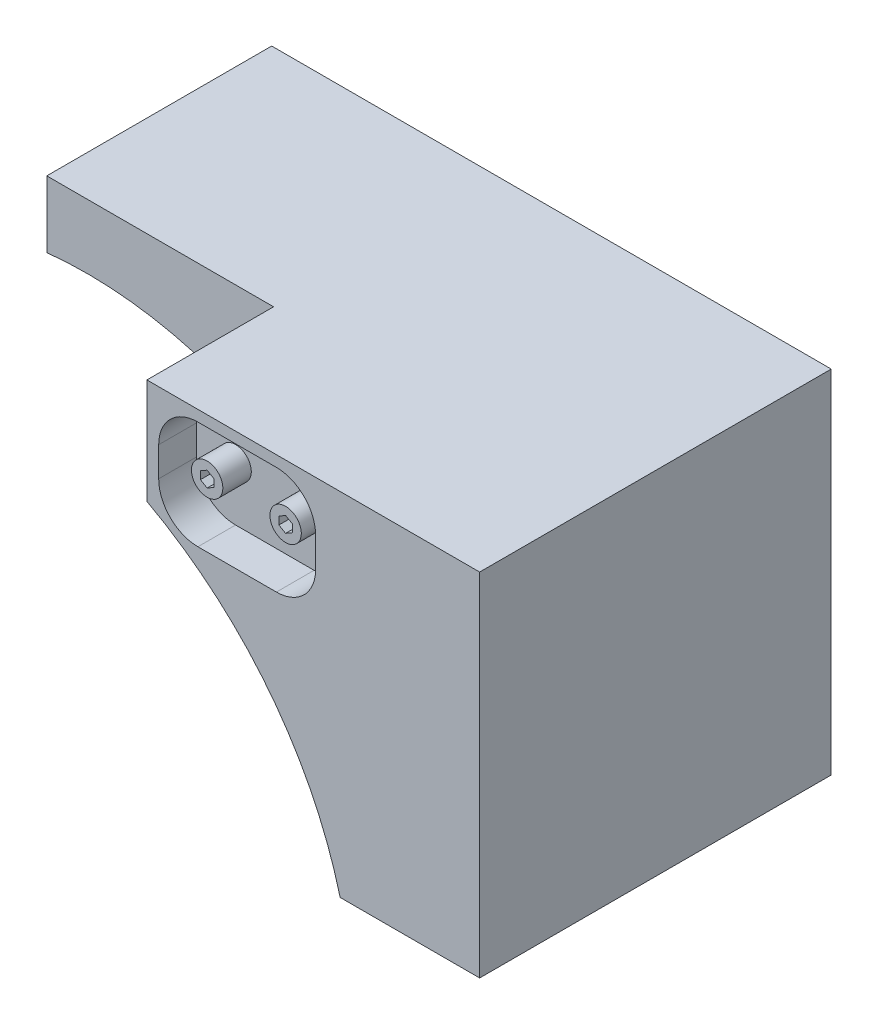
ISO-10303-21;
HEADER;
FILE_DESCRIPTION(('STEP AP214'),'2;1');
FILE_NAME('part.step','',(''),(''),'','','');
FILE_SCHEMA(('AUTOMOTIVE_DESIGN { 1 0 10303 214 1 1 1 1 }'));
ENDSEC;
DATA;
#1=APPLICATION_CONTEXT('core data for automotive mechanical design processes');
#2=APPLICATION_PROTOCOL_DEFINITION('international standard','automotive_design',2000,#1);
#3=PRODUCT_CONTEXT('',#1,'mechanical');
#4=PRODUCT('Part','Part','',(#3));
#5=PRODUCT_RELATED_PRODUCT_CATEGORY('part','',(#4));
#6=PRODUCT_DEFINITION_FORMATION('','',#4);
#7=PRODUCT_DEFINITION_CONTEXT('part definition',#1,'design');
#8=PRODUCT_DEFINITION('design','',#6,#7);
#9=PRODUCT_DEFINITION_SHAPE('','',#8);
#10=(LENGTH_UNIT() NAMED_UNIT(*) SI_UNIT(.MILLI.,.METRE.));
#11=(NAMED_UNIT(*) PLANE_ANGLE_UNIT() SI_UNIT($,.RADIAN.));
#12=(NAMED_UNIT(*) SI_UNIT($,.STERADIAN.) SOLID_ANGLE_UNIT());
#13=UNCERTAINTY_MEASURE_WITH_UNIT(LENGTH_MEASURE(1.E-05),#10,'distance_accuracy_value','');
#14=(GEOMETRIC_REPRESENTATION_CONTEXT(3) GLOBAL_UNCERTAINTY_ASSIGNED_CONTEXT((#13)) GLOBAL_UNIT_ASSIGNED_CONTEXT((#10,
#11,#12)) REPRESENTATION_CONTEXT('',''));
#15=CARTESIAN_POINT('',(0.,0.,0.));
#16=DIRECTION('',(0.,0.,1.));
#17=DIRECTION('',(1.,0.,0.));
#18=AXIS2_PLACEMENT_3D('',#15,#16,#17);
#19=CARTESIAN_POINT('',(658.837491164178,534.14860150002,56.8037083256615));
#20=DIRECTION('',(0.500000000000038,0.866025403784417,0.));
#21=DIRECTION('',(-0.866025403784417,0.500000000000038,0.));
#22=AXIS2_PLACEMENT_3D('',#19,#20,#21);
#23=PLANE('',#22);
#24=DIRECTION('',(0.,0.,-1.));
#25=VECTOR('',#24,1.);
#26=CARTESIAN_POINT('',(658.837491164178,534.14860150002,56.8037083256615));
#27=LINE('',#26,#25);
#28=CARTESIAN_POINT('',(658.837491164178,534.14860150002,53.6287083256614));
#29=VERTEX_POINT('',#28);
#30=CARTESIAN_POINT('',(658.837491164178,534.14860150002,56.8037083256615));
#31=VERTEX_POINT('',#30);
#32=EDGE_CURVE('E328',#29,#31,#27,.F.);
#33=ORIENTED_EDGE('',*,*,#32,.T.);
#34=DIRECTION('',(-0.866025403784417,0.500000000000038,0.));
#35=VECTOR('',#34,1.);
#36=CARTESIAN_POINT('',(658.837491164178,534.14860150002,56.8037083256615));
#37=LINE('',#36,#35);
#38=CARTESIAN_POINT('',(657.752178948284,534.775206800021,56.8037083256615));
#39=VERTEX_POINT('',#38);
#40=EDGE_CURVE('E337',#39,#31,#37,.F.);
#41=ORIENTED_EDGE('',*,*,#40,.F.);
#42=DIRECTION('',(0.,0.,1.));
#43=VECTOR('',#42,1.);
#44=CARTESIAN_POINT('',(657.752178948284,534.77520680002,56.8037083256615));
#45=LINE('',#44,#43);
#46=CARTESIAN_POINT('',(657.752178948284,534.775206800021,53.6287083256614));
#47=VERTEX_POINT('',#46);
#48=EDGE_CURVE('E318',#39,#47,#45,.F.);
#49=ORIENTED_EDGE('',*,*,#48,.T.);
#50=DIRECTION('',(-0.866025403784417,0.500000000000038,0.));
#51=VECTOR('',#50,1.);
#52=CARTESIAN_POINT('',(658.837491164178,534.14860150002,53.6287083256614));
#53=LINE('',#52,#51);
#54=EDGE_CURVE('E335',#29,#47,#53,.T.);
#55=ORIENTED_EDGE('',*,*,#54,.F.);
#56=EDGE_LOOP('',(#33,#41,#49,#55));
#57=FACE_BOUND('',#56,.T.);
#58=ADVANCED_FACE('F16',(#57),#23,.F.);
#59=CARTESIAN_POINT('',(646.137491164178,534.14860150002,56.8037083256615));
#60=DIRECTION('',(0.500000000000038,0.866025403784417,0.));
#61=DIRECTION('',(-0.866025403784417,0.500000000000038,0.));
#62=AXIS2_PLACEMENT_3D('',#59,#60,#61);
#63=PLANE('',#62);
#64=DIRECTION('',(0.,0.,-1.));
#65=VECTOR('',#64,1.);
#66=CARTESIAN_POINT('',(646.137491164178,534.14860150002,56.8037083256615));
#67=LINE('',#66,#65);
#68=CARTESIAN_POINT('',(646.137491164178,534.14860150002,53.6287083256614));
#69=VERTEX_POINT('',#68);
#70=CARTESIAN_POINT('',(646.137491164178,534.14860150002,56.8037083256615));
#71=VERTEX_POINT('',#70);
#72=EDGE_CURVE('E313',#69,#71,#67,.F.);
#73=ORIENTED_EDGE('',*,*,#72,.T.);
#74=DIRECTION('',(-0.866025403784417,0.500000000000038,0.));
#75=VECTOR('',#74,1.);
#76=CARTESIAN_POINT('',(646.137491164178,534.14860150002,56.8037083256615));
#77=LINE('',#76,#75);
#78=CARTESIAN_POINT('',(645.052178948284,534.775206800021,56.8037083256615));
#79=VERTEX_POINT('',#78);
#80=EDGE_CURVE('E333',#79,#71,#77,.F.);
#81=ORIENTED_EDGE('',*,*,#80,.F.);
#82=DIRECTION('',(0.,0.,1.));
#83=VECTOR('',#82,1.);
#84=CARTESIAN_POINT('',(645.052178948284,534.77520680002,56.8037083256615));
#85=LINE('',#84,#83);
#86=CARTESIAN_POINT('',(645.052178948284,534.775206800021,53.6287083256614));
#87=VERTEX_POINT('',#86);
#88=EDGE_CURVE('E303',#79,#87,#85,.F.);
#89=ORIENTED_EDGE('',*,*,#88,.T.);
#90=DIRECTION('',(-0.866025403784417,0.500000000000038,0.));
#91=VECTOR('',#90,1.);
#92=CARTESIAN_POINT('',(646.137491164178,534.14860150002,53.6287083256614));
#93=LINE('',#92,#91);
#94=EDGE_CURVE('E331',#69,#87,#93,.T.);
#95=ORIENTED_EDGE('',*,*,#94,.F.);
#96=EDGE_LOOP('',(#73,#81,#89,#95));
#97=FACE_BOUND('',#96,.T.);
#98=ADVANCED_FACE('F426',(#97),#63,.F.);
#99=CARTESIAN_POINT('',(658.837491164178,532.89539090002,56.8037083256615));
#100=DIRECTION('',(1.,0.,0.));
#101=DIRECTION('',(0.,0.,-1.));
#102=AXIS2_PLACEMENT_3D('',#99,#100,#101);
#103=PLANE('',#102);
#104=DIRECTION('',(0.,0.,1.));
#105=VECTOR('',#104,1.);
#106=CARTESIAN_POINT('',(658.837491164178,532.895390900021,56.8037083256615));
#107=LINE('',#106,#105);
#108=CARTESIAN_POINT('',(658.837491164178,532.895390900021,53.6287083256614));
#109=VERTEX_POINT('',#108);
#110=CARTESIAN_POINT('',(658.837491164178,532.895390900021,56.8037083256615));
#111=VERTEX_POINT('',#110);
#112=EDGE_CURVE('E298',#109,#111,#107,.T.);
#113=ORIENTED_EDGE('',*,*,#112,.T.);
#114=DIRECTION('',(0.,1.,0.));
#115=VECTOR('',#114,1.);
#116=CARTESIAN_POINT('',(658.837491164178,532.89539090002,56.8037083256615));
#117=LINE('',#116,#115);
#118=EDGE_CURVE('E326',#31,#111,#117,.F.);
#119=ORIENTED_EDGE('',*,*,#118,.F.);
#120=ORIENTED_EDGE('',*,*,#32,.F.);
#121=DIRECTION('',(0.,1.,0.));
#122=VECTOR('',#121,1.);
#123=CARTESIAN_POINT('',(658.837491164178,532.89539090002,53.6287083256614));
#124=LINE('',#123,#122);
#125=EDGE_CURVE('E323',#109,#29,#124,.T.);
#126=ORIENTED_EDGE('',*,*,#125,.F.);
#127=EDGE_LOOP('',(#113,#119,#120,#126));
#128=FACE_BOUND('',#127,.T.);
#129=ADVANCED_FACE('F424',(#128),#103,.F.);
#130=CARTESIAN_POINT('',(657.752178948284,534.77520680002,56.8037083256615));
#131=DIRECTION('',(-0.499999999999984,0.866025403784448,0.));
#132=DIRECTION('',(-0.866025403784448,-0.499999999999984,0.));
#133=AXIS2_PLACEMENT_3D('',#130,#131,#132);
#134=PLANE('',#133);
#135=ORIENTED_EDGE('',*,*,#48,.F.);
#136=DIRECTION('',(-0.866025403784448,-0.499999999999984,0.));
#137=VECTOR('',#136,1.);
#138=CARTESIAN_POINT('',(657.752178948284,534.77520680002,56.8037083256615));
#139=LINE('',#138,#137);
#140=CARTESIAN_POINT('',(656.666866732393,534.148601500021,56.8037083256615));
#141=VERTEX_POINT('',#140);
#142=EDGE_CURVE('E321',#141,#39,#139,.F.);
#143=ORIENTED_EDGE('',*,*,#142,.F.);
#144=DIRECTION('',(0.,0.,1.));
#145=VECTOR('',#144,1.);
#146=CARTESIAN_POINT('',(656.666866732393,534.14860150002,56.8037083256615));
#147=LINE('',#146,#145);
#148=CARTESIAN_POINT('',(656.666866732393,534.148601500021,53.6287083256614));
#149=VERTEX_POINT('',#148);
#150=EDGE_CURVE('E291',#141,#149,#147,.F.);
#151=ORIENTED_EDGE('',*,*,#150,.T.);
#152=DIRECTION('',(-0.866025403784448,-0.499999999999984,0.));
#153=VECTOR('',#152,1.);
#154=CARTESIAN_POINT('',(657.752178948284,534.77520680002,53.6287083256614));
#155=LINE('',#154,#153);
#156=EDGE_CURVE('E316',#47,#149,#155,.T.);
#157=ORIENTED_EDGE('',*,*,#156,.F.);
#158=EDGE_LOOP('',(#135,#143,#151,#157));
#159=FACE_BOUND('',#158,.T.);
#160=ADVANCED_FACE('F419',(#159),#134,.F.);
#161=CARTESIAN_POINT('',(646.137491164178,532.89539090002,56.8037083256615));
#162=DIRECTION('',(1.,0.,0.));
#163=DIRECTION('',(0.,0.,-1.));
#164=AXIS2_PLACEMENT_3D('',#161,#162,#163);
#165=PLANE('',#164);
#166=DIRECTION('',(0.,0.,1.));
#167=VECTOR('',#166,1.);
#168=CARTESIAN_POINT('',(646.137491164178,532.895390900021,56.8037083256615));
#169=LINE('',#168,#167);
#170=CARTESIAN_POINT('',(646.137491164178,532.895390900021,53.6287083256614));
#171=VERTEX_POINT('',#170);
#172=CARTESIAN_POINT('',(646.137491164178,532.895390900021,56.8037083256615));
#173=VERTEX_POINT('',#172);
#174=EDGE_CURVE('E283',#171,#173,#169,.T.);
#175=ORIENTED_EDGE('',*,*,#174,.T.);
#176=DIRECTION('',(0.,1.,0.));
#177=VECTOR('',#176,1.);
#178=CARTESIAN_POINT('',(646.137491164178,532.89539090002,56.8037083256615));
#179=LINE('',#178,#177);
#180=EDGE_CURVE('E311',#71,#173,#179,.F.);
#181=ORIENTED_EDGE('',*,*,#180,.F.);
#182=ORIENTED_EDGE('',*,*,#72,.F.);
#183=DIRECTION('',(0.,1.,0.));
#184=VECTOR('',#183,1.);
#185=CARTESIAN_POINT('',(646.137491164178,532.89539090002,53.6287083256614));
#186=LINE('',#185,#184);
#187=EDGE_CURVE('E308',#171,#69,#186,.T.);
#188=ORIENTED_EDGE('',*,*,#187,.F.);
#189=EDGE_LOOP('',(#175,#181,#182,#188));
#190=FACE_BOUND('',#189,.T.);
#191=ADVANCED_FACE('F433',(#190),#165,.F.);
#192=CARTESIAN_POINT('',(645.052178948284,534.77520680002,56.8037083256615));
#193=DIRECTION('',(-0.499999999999984,0.866025403784448,0.));
#194=DIRECTION('',(-0.866025403784448,-0.499999999999984,0.));
#195=AXIS2_PLACEMENT_3D('',#192,#193,#194);
#196=PLANE('',#195);
#197=ORIENTED_EDGE('',*,*,#88,.F.);
#198=DIRECTION('',(-0.866025403784448,-0.499999999999984,0.));
#199=VECTOR('',#198,1.);
#200=CARTESIAN_POINT('',(645.052178948284,534.77520680002,56.8037083256615));
#201=LINE('',#200,#199);
#202=CARTESIAN_POINT('',(643.966866732393,534.148601500021,56.8037083256615));
#203=VERTEX_POINT('',#202);
#204=EDGE_CURVE('E306',#203,#79,#201,.F.);
#205=ORIENTED_EDGE('',*,*,#204,.F.);
#206=DIRECTION('',(0.,0.,1.));
#207=VECTOR('',#206,1.);
#208=CARTESIAN_POINT('',(643.966866732393,534.14860150002,56.8037083256615));
#209=LINE('',#208,#207);
#210=CARTESIAN_POINT('',(643.966866732393,534.148601500021,53.6287083256614));
#211=VERTEX_POINT('',#210);
#212=EDGE_CURVE('E276',#203,#211,#209,.F.);
#213=ORIENTED_EDGE('',*,*,#212,.T.);
#214=DIRECTION('',(-0.866025403784448,-0.499999999999984,0.));
#215=VECTOR('',#214,1.);
#216=CARTESIAN_POINT('',(645.052178948284,534.77520680002,53.6287083256614));
#217=LINE('',#216,#215);
#218=EDGE_CURVE('E301',#87,#211,#217,.T.);
#219=ORIENTED_EDGE('',*,*,#218,.F.);
#220=EDGE_LOOP('',(#197,#205,#213,#219));
#221=FACE_BOUND('',#220,.T.);
#222=ADVANCED_FACE('F546',(#221),#196,.F.);
#223=CARTESIAN_POINT('',(657.752178948284,532.26878560002,56.8037083256615));
#224=DIRECTION('',(0.499999999999984,-0.866025403784448,0.));
#225=DIRECTION('',(0.866025403784448,0.499999999999984,0.));
#226=AXIS2_PLACEMENT_3D('',#223,#224,#225);
#227=PLANE('',#226);
#228=DIRECTION('',(0.,0.,1.));
#229=VECTOR('',#228,1.);
#230=CARTESIAN_POINT('',(657.752178948284,532.268785600021,56.8037083256615));
#231=LINE('',#230,#229);
#232=CARTESIAN_POINT('',(657.752178948284,532.26878560002,53.6287083256614));
#233=VERTEX_POINT('',#232);
#234=CARTESIAN_POINT('',(657.752178948284,532.26878560002,56.8037083256615));
#235=VERTEX_POINT('',#234);
#236=EDGE_CURVE('E268',#233,#235,#231,.T.);
#237=ORIENTED_EDGE('',*,*,#236,.T.);
#238=DIRECTION('',(0.866025403784448,0.499999999999984,0.));
#239=VECTOR('',#238,1.);
#240=CARTESIAN_POINT('',(657.752178948284,532.26878560002,56.8037083256615));
#241=LINE('',#240,#239);
#242=EDGE_CURVE('E296',#111,#235,#241,.F.);
#243=ORIENTED_EDGE('',*,*,#242,.F.);
#244=ORIENTED_EDGE('',*,*,#112,.F.);
#245=DIRECTION('',(-0.866025403784824,-0.499999999999332,0.));
#246=VECTOR('',#245,1.);
#247=CARTESIAN_POINT('',(658.837491164178,532.89539090002,53.6287083256614));
#248=LINE('',#247,#246);
#249=EDGE_CURVE('E289',#109,#233,#248,.T.);
#250=ORIENTED_EDGE('',*,*,#249,.T.);
#251=EDGE_LOOP('',(#237,#243,#244,#250));
#252=FACE_BOUND('',#251,.T.);
#253=ADVANCED_FACE('F403',(#252),#227,.F.);
#254=CARTESIAN_POINT('',(656.666866732393,534.14860150002,56.8037083256615));
#255=DIRECTION('',(-1.,0.,0.));
#256=DIRECTION('',(0.,0.,1.));
#257=AXIS2_PLACEMENT_3D('',#254,#255,#256);
#258=PLANE('',#257);
#259=ORIENTED_EDGE('',*,*,#150,.F.);
#260=DIRECTION('',(0.,1.,0.));
#261=VECTOR('',#260,1.);
#262=CARTESIAN_POINT('',(656.666866732393,534.14860150002,56.8037083256615));
#263=LINE('',#262,#261);
#264=CARTESIAN_POINT('',(656.666866732393,532.89539090002,56.8037083256615));
#265=VERTEX_POINT('',#264);
#266=EDGE_CURVE('E294',#265,#141,#263,.T.);
#267=ORIENTED_EDGE('',*,*,#266,.F.);
#268=DIRECTION('',(0.,0.,1.));
#269=VECTOR('',#268,1.);
#270=CARTESIAN_POINT('',(656.666866732393,532.89539090002,56.8037083256615));
#271=LINE('',#270,#269);
#272=CARTESIAN_POINT('',(656.666866732393,532.89539090002,53.6287083256614));
#273=VERTEX_POINT('',#272);
#274=EDGE_CURVE('E266',#265,#273,#271,.F.);
#275=ORIENTED_EDGE('',*,*,#274,.T.);
#276=DIRECTION('',(0.,1.,0.));
#277=VECTOR('',#276,1.);
#278=CARTESIAN_POINT('',(656.666866732393,534.14860150002,53.6287083256614));
#279=LINE('',#278,#277);
#280=EDGE_CURVE('E286',#273,#149,#279,.T.);
#281=ORIENTED_EDGE('',*,*,#280,.T.);
#282=EDGE_LOOP('',(#259,#267,#275,#281));
#283=FACE_BOUND('',#282,.T.);
#284=ADVANCED_FACE('F412',(#283),#258,.F.);
#285=CARTESIAN_POINT('',(656.666866732393,534.14860150002,53.6287083256614));
#286=DIRECTION('',(0.,0.,-1.));
#287=DIRECTION('',(-1.,0.,0.));
#288=AXIS2_PLACEMENT_3D('',#285,#286,#287);
#289=PLANE('',#288);
#290=DIRECTION('',(0.866025403784417,-0.500000000000038,0.));
#291=VECTOR('',#290,1.);
#292=CARTESIAN_POINT('',(656.666866732393,532.89539090002,53.6287083256614));
#293=LINE('',#292,#291);
#294=EDGE_CURVE('E263',#273,#233,#293,.T.);
#295=ORIENTED_EDGE('',*,*,#294,.T.);
#296=ORIENTED_EDGE('',*,*,#249,.F.);
#297=ORIENTED_EDGE('',*,*,#125,.T.);
#298=ORIENTED_EDGE('',*,*,#54,.T.);
#299=ORIENTED_EDGE('',*,*,#156,.T.);
#300=ORIENTED_EDGE('',*,*,#280,.F.);
#301=EDGE_LOOP('',(#295,#296,#297,#298,#299,#300));
#302=FACE_BOUND('',#301,.T.);
#303=ADVANCED_FACE('F414',(#302),#289,.F.);
#304=CARTESIAN_POINT('',(645.052178948284,532.26878560002,56.8037083256615));
#305=DIRECTION('',(0.499999999999984,-0.866025403784448,0.));
#306=DIRECTION('',(0.866025403784448,0.499999999999984,0.));
#307=AXIS2_PLACEMENT_3D('',#304,#305,#306);
#308=PLANE('',#307);
#309=DIRECTION('',(0.,0.,1.));
#310=VECTOR('',#309,1.);
#311=CARTESIAN_POINT('',(645.052178948284,532.268785600021,56.8037083256615));
#312=LINE('',#311,#310);
#313=CARTESIAN_POINT('',(645.052178948284,532.26878560002,53.6287083256614));
#314=VERTEX_POINT('',#313);
#315=CARTESIAN_POINT('',(645.052178948284,532.26878560002,56.8037083256615));
#316=VERTEX_POINT('',#315);
#317=EDGE_CURVE('E260',#314,#316,#312,.T.);
#318=ORIENTED_EDGE('',*,*,#317,.T.);
#319=DIRECTION('',(0.866025403784448,0.499999999999984,0.));
#320=VECTOR('',#319,1.);
#321=CARTESIAN_POINT('',(645.052178948284,532.26878560002,56.8037083256615));
#322=LINE('',#321,#320);
#323=EDGE_CURVE('E281',#173,#316,#322,.F.);
#324=ORIENTED_EDGE('',*,*,#323,.F.);
#325=ORIENTED_EDGE('',*,*,#174,.F.);
#326=DIRECTION('',(-0.866025403784846,-0.499999999999294,0.));
#327=VECTOR('',#326,1.);
#328=CARTESIAN_POINT('',(646.137491164178,532.89539090002,53.6287083256614));
#329=LINE('',#328,#327);
#330=EDGE_CURVE('E274',#171,#314,#329,.T.);
#331=ORIENTED_EDGE('',*,*,#330,.T.);
#332=EDGE_LOOP('',(#318,#324,#325,#331));
#333=FACE_BOUND('',#332,.T.);
#334=ADVANCED_FACE('F535',(#333),#308,.F.);
#335=CARTESIAN_POINT('',(643.966866732393,534.14860150002,56.8037083256615));
#336=DIRECTION('',(-1.,0.,0.));
#337=DIRECTION('',(0.,0.,1.));
#338=AXIS2_PLACEMENT_3D('',#335,#336,#337);
#339=PLANE('',#338);
#340=ORIENTED_EDGE('',*,*,#212,.F.);
#341=DIRECTION('',(0.,1.,0.));
#342=VECTOR('',#341,1.);
#343=CARTESIAN_POINT('',(643.966866732393,534.14860150002,56.8037083256615));
#344=LINE('',#343,#342);
#345=CARTESIAN_POINT('',(643.966866732393,532.89539090002,56.8037083256615));
#346=VERTEX_POINT('',#345);
#347=EDGE_CURVE('E279',#346,#203,#344,.T.);
#348=ORIENTED_EDGE('',*,*,#347,.F.);
#349=DIRECTION('',(0.,0.,1.));
#350=VECTOR('',#349,1.);
#351=CARTESIAN_POINT('',(643.966866732393,532.89539090002,56.8037083256615));
#352=LINE('',#351,#350);
#353=CARTESIAN_POINT('',(643.966866732393,532.89539090002,53.6287083256614));
#354=VERTEX_POINT('',#353);
#355=EDGE_CURVE('E258',#346,#354,#352,.F.);
#356=ORIENTED_EDGE('',*,*,#355,.T.);
#357=DIRECTION('',(0.,1.,0.));
#358=VECTOR('',#357,1.);
#359=CARTESIAN_POINT('',(643.966866732393,534.14860150002,53.6287083256614));
#360=LINE('',#359,#358);
#361=EDGE_CURVE('E271',#354,#211,#360,.T.);
#362=ORIENTED_EDGE('',*,*,#361,.T.);
#363=EDGE_LOOP('',(#340,#348,#356,#362));
#364=FACE_BOUND('',#363,.T.);
#365=ADVANCED_FACE('F531',(#364),#339,.F.);
#366=CARTESIAN_POINT('',(643.966866732393,534.14860150002,53.6287083256614));
#367=DIRECTION('',(0.,0.,-1.));
#368=DIRECTION('',(-1.,0.,0.));
#369=AXIS2_PLACEMENT_3D('',#366,#367,#368);
#370=PLANE('',#369);
#371=DIRECTION('',(0.866025403784417,-0.500000000000038,0.));
#372=VECTOR('',#371,1.);
#373=CARTESIAN_POINT('',(643.966866732393,532.89539090002,53.6287083256614));
#374=LINE('',#373,#372);
#375=EDGE_CURVE('E255',#354,#314,#374,.T.);
#376=ORIENTED_EDGE('',*,*,#375,.T.);
#377=ORIENTED_EDGE('',*,*,#330,.F.);
#378=ORIENTED_EDGE('',*,*,#187,.T.);
#379=ORIENTED_EDGE('',*,*,#94,.T.);
#380=ORIENTED_EDGE('',*,*,#218,.T.);
#381=ORIENTED_EDGE('',*,*,#361,.F.);
#382=EDGE_LOOP('',(#376,#377,#378,#379,#380,#381));
#383=FACE_BOUND('',#382,.T.);
#384=ADVANCED_FACE('F528',(#383),#370,.F.);
#385=CARTESIAN_POINT('',(656.666866732393,532.89539090002,56.8037083256615));
#386=DIRECTION('',(-0.500000000000038,-0.866025403784417,0.));
#387=DIRECTION('',(0.866025403784417,-0.500000000000038,0.));
#388=AXIS2_PLACEMENT_3D('',#385,#386,#387);
#389=PLANE('',#388);
#390=ORIENTED_EDGE('',*,*,#274,.F.);
#391=DIRECTION('',(-0.866025403784315,0.500000000000214,0.));
#392=VECTOR('',#391,1.);
#393=CARTESIAN_POINT('',(657.752178948284,532.26878560002,56.8037083256615));
#394=LINE('',#393,#392);
#395=EDGE_CURVE('E252',#235,#265,#394,.T.);
#396=ORIENTED_EDGE('',*,*,#395,.F.);
#397=ORIENTED_EDGE('',*,*,#236,.F.);
#398=ORIENTED_EDGE('',*,*,#294,.F.);
#399=EDGE_LOOP('',(#390,#396,#397,#398));
#400=FACE_BOUND('',#399,.T.);
#401=ADVANCED_FACE('F408',(#400),#389,.F.);
#402=CARTESIAN_POINT('',(643.966866732393,532.89539090002,56.8037083256615));
#403=DIRECTION('',(-0.500000000000038,-0.866025403784417,0.));
#404=DIRECTION('',(0.866025403784417,-0.500000000000038,0.));
#405=AXIS2_PLACEMENT_3D('',#402,#403,#404);
#406=PLANE('',#405);
#407=ORIENTED_EDGE('',*,*,#355,.F.);
#408=DIRECTION('',(-0.866025403784315,0.500000000000214,0.));
#409=VECTOR('',#408,1.);
#410=CARTESIAN_POINT('',(645.052178948284,532.26878560002,56.8037083256615));
#411=LINE('',#410,#409);
#412=EDGE_CURVE('E249',#316,#346,#411,.T.);
#413=ORIENTED_EDGE('',*,*,#412,.F.);
#414=ORIENTED_EDGE('',*,*,#317,.F.);
#415=ORIENTED_EDGE('',*,*,#375,.F.);
#416=EDGE_LOOP('',(#407,#413,#414,#415));
#417=FACE_BOUND('',#416,.T.);
#418=ADVANCED_FACE('F395',(#417),#406,.F.);
#419=CARTESIAN_POINT('',(660.292178948287,533.52199620002,56.8037083256615));
#420=DIRECTION('',(0.,0.,1.));
#421=DIRECTION('',(1.,0.,0.));
#422=AXIS2_PLACEMENT_3D('',#419,#420,#421);
#423=PLANE('',#422);
#424=CARTESIAN_POINT('',(657.752178948284,533.52199620002,56.8037083256615));
#425=DIRECTION('',(0.,0.,-1.));
#426=DIRECTION('',(-1.,0.,0.));
#427=AXIS2_PLACEMENT_3D('',#424,#425,#426);
#428=CIRCLE('',#427,2.54000000000003);
#429=CARTESIAN_POINT('',(655.212178948284,533.52199620002,56.8037083256615));
#430=VERTEX_POINT('',#429);
#431=EDGE_CURVE('E19',#430,#430,#428,.T.);
#432=ORIENTED_EDGE('',*,*,#431,.F.);
#433=EDGE_LOOP('',(#432));
#434=FACE_BOUND('',#433,.T.);
#435=ORIENTED_EDGE('',*,*,#242,.T.);
#436=ORIENTED_EDGE('',*,*,#395,.T.);
#437=ORIENTED_EDGE('',*,*,#266,.T.);
#438=ORIENTED_EDGE('',*,*,#142,.T.);
#439=ORIENTED_EDGE('',*,*,#40,.T.);
#440=ORIENTED_EDGE('',*,*,#118,.T.);
#441=EDGE_LOOP('',(#435,#436,#437,#438,#439,#440));
#442=FACE_BOUND('',#441,.T.);
#443=ADVANCED_FACE('F391',(#434,#442),#423,.T.);
#444=CARTESIAN_POINT('',(647.592178948287,533.52199620002,56.8037083256615));
#445=DIRECTION('',(0.,0.,1.));
#446=DIRECTION('',(1.,0.,0.));
#447=AXIS2_PLACEMENT_3D('',#444,#445,#446);
#448=PLANE('',#447);
#449=CARTESIAN_POINT('',(645.052178948284,533.52199620002,56.8037083256615));
#450=DIRECTION('',(0.,0.,-1.));
#451=DIRECTION('',(-1.,0.,0.));
#452=AXIS2_PLACEMENT_3D('',#449,#450,#451);
#453=CIRCLE('',#452,2.54000000000003);
#454=CARTESIAN_POINT('',(642.512178948284,533.52199620002,56.8037083256615));
#455=VERTEX_POINT('',#454);
#456=EDGE_CURVE('E382',#455,#455,#453,.T.);
#457=ORIENTED_EDGE('',*,*,#456,.F.);
#458=EDGE_LOOP('',(#457));
#459=FACE_BOUND('',#458,.T.);
#460=ORIENTED_EDGE('',*,*,#323,.T.);
#461=ORIENTED_EDGE('',*,*,#412,.T.);
#462=ORIENTED_EDGE('',*,*,#347,.T.);
#463=ORIENTED_EDGE('',*,*,#204,.T.);
#464=ORIENTED_EDGE('',*,*,#80,.T.);
#465=ORIENTED_EDGE('',*,*,#180,.T.);
#466=EDGE_LOOP('',(#460,#461,#462,#463,#464,#465));
#467=FACE_BOUND('',#466,.T.);
#468=ADVANCED_FACE('F394',(#459,#467),#448,.T.);
#469=CARTESIAN_POINT('',(657.752178948284,533.52199620002,47.2787083256614));
#470=DIRECTION('',(0.,0.,-1.));
#471=DIRECTION('',(-1.,0.,0.));
#472=AXIS2_PLACEMENT_3D('',#469,#470,#471);
#473=CYLINDRICAL_SURFACE('',#472,2.54000000000003);
#474=CARTESIAN_POINT('',(657.752178948284,533.52199620002,52.197));
#475=DIRECTION('',(0.,0.,-1.));
#476=DIRECTION('',(-1.,0.,0.));
#477=AXIS2_PLACEMENT_3D('',#474,#475,#476);
#478=CIRCLE('',#477,2.54000000000003);
#479=CARTESIAN_POINT('',(655.212178948284,533.52199620002,52.197));
#480=VERTEX_POINT('',#479);
#481=EDGE_CURVE('E380',#480,#480,#478,.F.);
#482=ORIENTED_EDGE('',*,*,#481,.T.);
#483=EDGE_LOOP('',(#482));
#484=FACE_BOUND('',#483,.T.);
#485=ORIENTED_EDGE('',*,*,#431,.T.);
#486=EDGE_LOOP('',(#485));
#487=FACE_BOUND('',#486,.T.);
#488=ADVANCED_FACE('F389',(#484,#487),#473,.T.);
#489=CARTESIAN_POINT('',(645.052178948284,533.52199620002,47.2787083256614));
#490=DIRECTION('',(0.,0.,-1.));
#491=DIRECTION('',(-1.,0.,0.));
#492=AXIS2_PLACEMENT_3D('',#489,#490,#491);
#493=CYLINDRICAL_SURFACE('',#492,2.54000000000003);
#494=CARTESIAN_POINT('',(645.052178948284,533.52199620002,52.197));
#495=DIRECTION('',(0.,0.,-1.));
#496=DIRECTION('',(-1.,0.,0.));
#497=AXIS2_PLACEMENT_3D('',#494,#495,#496);
#498=CIRCLE('',#497,2.54000000000003);
#499=CARTESIAN_POINT('',(642.512178948284,533.52199620002,52.197));
#500=VERTEX_POINT('',#499);
#501=EDGE_CURVE('E235',#500,#500,#498,.F.);
#502=ORIENTED_EDGE('',*,*,#501,.T.);
#503=EDGE_LOOP('',(#502));
#504=FACE_BOUND('',#503,.T.);
#505=ORIENTED_EDGE('',*,*,#456,.T.);
#506=EDGE_LOOP('',(#505));
#507=FACE_BOUND('',#506,.T.);
#508=ADVANCED_FACE('F513',(#504,#507),#493,.T.);
#509=CARTESIAN_POINT('',(648.862194188289,533.044464262686,52.197));
#510=DIRECTION('',(0.,0.,-1.));
#511=DIRECTION('',(-1.,0.,0.));
#512=AXIS2_PLACEMENT_3D('',#509,#510,#511);
#513=PLANE('',#512);
#514=CARTESIAN_POINT('',(657.752178948264,535.9095708,52.197));
#515=DIRECTION('',(0.,0.,-1.));
#516=DIRECTION('',(-1.,0.,0.));
#517=AXIS2_PLACEMENT_3D('',#514,#515,#516);
#518=CIRCLE('',#517,6.35);
#519=CARTESIAN_POINT('',(664.102178948264,535.9095708,52.197));
#520=VERTEX_POINT('',#519);
#521=CARTESIAN_POINT('',(657.752178948264,542.2595708,52.197));
#522=VERTEX_POINT('',#521);
#523=EDGE_CURVE('E204',#520,#522,#518,.F.);
#524=ORIENTED_EDGE('',*,*,#523,.T.);
#525=DIRECTION('',(1.,0.,0.));
#526=VECTOR('',#525,1.);
#527=CARTESIAN_POINT('',(638.702204348307,542.2595708,52.197));
#528=LINE('',#527,#526);
#529=CARTESIAN_POINT('',(645.052204348307,542.2595708,52.197));
#530=VERTEX_POINT('',#529);
#531=EDGE_CURVE('E246',#522,#530,#528,.F.);
#532=ORIENTED_EDGE('',*,*,#531,.T.);
#533=CARTESIAN_POINT('',(645.052204348307,535.9095708,52.197));
#534=DIRECTION('',(0.,0.,-1.));
#535=DIRECTION('',(-1.,0.,0.));
#536=AXIS2_PLACEMENT_3D('',#533,#534,#535);
#537=CIRCLE('',#536,6.35);
#538=CARTESIAN_POINT('',(638.702204348307,535.9095708,52.197));
#539=VERTEX_POINT('',#538);
#540=EDGE_CURVE('E376',#530,#539,#537,.F.);
#541=ORIENTED_EDGE('',*,*,#540,.T.);
#542=DIRECTION('',(0.,1.,0.));
#543=VECTOR('',#542,1.);
#544=CARTESIAN_POINT('',(638.702204348307,531.134387313389,52.197));
#545=LINE('',#544,#543);
#546=CARTESIAN_POINT('',(638.702204348307,531.13439620002,52.197));
#547=VERTEX_POINT('',#546);
#548=EDGE_CURVE('E241',#539,#547,#545,.F.);
#549=ORIENTED_EDGE('',*,*,#548,.T.);
#550=CARTESIAN_POINT('',(645.052204348307,531.13439620002,52.197));
#551=DIRECTION('',(0.,0.,-1.));
#552=DIRECTION('',(-1.,0.,0.));
#553=AXIS2_PLACEMENT_3D('',#550,#551,#552);
#554=CIRCLE('',#553,6.35);
#555=CARTESIAN_POINT('',(645.052204348307,524.78439620002,52.197));
#556=VERTEX_POINT('',#555);
#557=EDGE_CURVE('E374',#547,#556,#554,.F.);
#558=ORIENTED_EDGE('',*,*,#557,.T.);
#559=DIRECTION('',(1.,0.,0.));
#560=VECTOR('',#559,1.);
#561=CARTESIAN_POINT('',(664.102178948264,524.78439620002,52.197));
#562=LINE('',#561,#560);
#563=CARTESIAN_POINT('',(657.752178948264,524.78439620002,52.197));
#564=VERTEX_POINT('',#563);
#565=EDGE_CURVE('E237',#556,#564,#562,.T.);
#566=ORIENTED_EDGE('',*,*,#565,.T.);
#567=CARTESIAN_POINT('',(657.752178948264,531.13439620002,52.197));
#568=DIRECTION('',(0.,0.,-1.));
#569=DIRECTION('',(-1.,0.,0.));
#570=AXIS2_PLACEMENT_3D('',#567,#568,#569);
#571=CIRCLE('',#570,6.35);
#572=CARTESIAN_POINT('',(664.102178948264,531.13439620002,52.197));
#573=VERTEX_POINT('',#572);
#574=EDGE_CURVE('E220',#564,#573,#571,.F.);
#575=ORIENTED_EDGE('',*,*,#574,.T.);
#576=DIRECTION('',(0.,1.,0.));
#577=VECTOR('',#576,1.);
#578=CARTESIAN_POINT('',(664.102178948264,542.2595708,52.197));
#579=LINE('',#578,#577);
#580=EDGE_CURVE('E216',#573,#520,#579,.T.);
#581=ORIENTED_EDGE('',*,*,#580,.T.);
#582=EDGE_LOOP('',(#524,#532,#541,#549,#558,#566,#575,#581));
#583=FACE_BOUND('',#582,.T.);
#584=ORIENTED_EDGE('',*,*,#501,.F.);
#585=EDGE_LOOP('',(#584));
#586=FACE_BOUND('',#585,.T.);
#587=ORIENTED_EDGE('',*,*,#481,.F.);
#588=EDGE_LOOP('',(#587));
#589=FACE_BOUND('',#588,.T.);
#590=ADVANCED_FACE('F217',(#583,#586,#589),#513,.F.);
#591=CARTESIAN_POINT('',(663.39763792551,499.578659132103,1.397));
#592=DIRECTION('',(-0.00818479046068129,-0.999966504041568,0.));
#593=DIRECTION('',(0.999966504041568,-0.00818479046068129,0.));
#594=AXIS2_PLACEMENT_3D('',#591,#592,#593);
#595=PLANE('',#594);
#596=DIRECTION('',(0.,0.,-1.));
#597=VECTOR('',#596,1.);
#598=CARTESIAN_POINT('',(663.397637925509,499.578659132103,37.7952));
#599=LINE('',#598,#597);
#600=CARTESIAN_POINT('',(663.397637925509,499.578659132103,1.397));
#601=VERTEX_POINT('',#600);
#602=CARTESIAN_POINT('',(663.397637925509,499.578659132103,37.7952));
#603=VERTEX_POINT('',#602);
#604=EDGE_CURVE('E727',#601,#603,#599,.F.);
#605=ORIENTED_EDGE('',*,*,#604,.T.);
#606=DIRECTION('',(0.999966504041568,-0.00818479046068129,0.));
#607=VECTOR('',#606,1.);
#608=CARTESIAN_POINT('',(663.39763792551,499.578659132103,37.7952));
#609=LINE('',#608,#607);
#610=CARTESIAN_POINT('',(662.260245238228,499.587968764755,37.7952));
#611=VERTEX_POINT('',#610);
#612=EDGE_CURVE('E223',#603,#611,#609,.F.);
#613=ORIENTED_EDGE('',*,*,#612,.T.);
#614=DIRECTION('',(0.,0.,1.));
#615=VECTOR('',#614,1.);
#616=CARTESIAN_POINT('',(662.260245238228,499.587968764755,60.6298));
#617=LINE('',#616,#615);
#618=CARTESIAN_POINT('',(662.260245238228,499.587968764755,1.397));
#619=VERTEX_POINT('',#618);
#620=EDGE_CURVE('E735',#611,#619,#617,.F.);
#621=ORIENTED_EDGE('',*,*,#620,.T.);
#622=DIRECTION('',(0.999966504041568,-0.00818479046068129,0.));
#623=VECTOR('',#622,1.);
#624=CARTESIAN_POINT('',(663.39763792551,499.578659132103,1.39700000000001));
#625=LINE('',#624,#623);
#626=EDGE_CURVE('E233',#619,#601,#625,.T.);
#627=ORIENTED_EDGE('',*,*,#626,.T.);
#628=EDGE_LOOP('',(#605,#613,#621,#627));
#629=FACE_BOUND('',#628,.T.);
#630=ADVANCED_FACE('F507',(#629),#595,.T.);
#631=CARTESIAN_POINT('',(664.102178948264,542.2595708,52.197));
#632=DIRECTION('',(1.,0.,0.));
#633=DIRECTION('',(0.,1.,0.));
#634=AXIS2_PLACEMENT_3D('',#631,#632,#633);
#635=PLANE('',#634);
#636=DIRECTION('',(0.,0.,-1.));
#637=VECTOR('',#636,1.);
#638=CARTESIAN_POINT('',(664.102178948264,535.9095708,52.197));
#639=LINE('',#638,#637);
#640=CARTESIAN_POINT('',(664.102178948264,535.9095708,58.293));
#641=VERTEX_POINT('',#640);
#642=EDGE_CURVE('E210',#641,#520,#639,.T.);
#643=ORIENTED_EDGE('',*,*,#642,.T.);
#644=ORIENTED_EDGE('',*,*,#580,.F.);
#645=DIRECTION('',(0.,0.,-1.));
#646=VECTOR('',#645,1.);
#647=CARTESIAN_POINT('',(664.102178948264,531.13439620002,52.197));
#648=LINE('',#647,#646);
#649=CARTESIAN_POINT('',(664.102178948264,531.13439620002,58.293));
#650=VERTEX_POINT('',#649);
#651=EDGE_CURVE('E373',#573,#650,#648,.F.);
#652=ORIENTED_EDGE('',*,*,#651,.T.);
#653=DIRECTION('',(0.,1.,0.));
#654=VECTOR('',#653,1.);
#655=CARTESIAN_POINT('',(664.102178948264,544.0374438,58.293));
#656=LINE('',#655,#654);
#657=EDGE_CURVE('E228',#650,#641,#656,.T.);
#658=ORIENTED_EDGE('',*,*,#657,.T.);
#659=EDGE_LOOP('',(#643,#644,#652,#658));
#660=FACE_BOUND('',#659,.T.);
#661=ADVANCED_FACE('F226',(#660),#635,.F.);
#662=CARTESIAN_POINT('',(657.752178948264,535.9095708,52.197));
#663=DIRECTION('',(0.,0.,-1.));
#664=DIRECTION('',(-1.,0.,0.));
#665=AXIS2_PLACEMENT_3D('',#662,#663,#664);
#666=CYLINDRICAL_SURFACE('',#665,6.35);
#667=CARTESIAN_POINT('',(657.752178948264,535.9095708,58.293));
#668=DIRECTION('',(0.,0.,-1.));
#669=DIRECTION('',(-1.,0.,0.));
#670=AXIS2_PLACEMENT_3D('',#667,#668,#669);
#671=CIRCLE('',#670,6.35);
#672=CARTESIAN_POINT('',(657.752178948264,542.2595708,58.293));
#673=VERTEX_POINT('',#672);
#674=EDGE_CURVE('E370',#641,#673,#671,.F.);
#675=ORIENTED_EDGE('',*,*,#674,.T.);
#676=DIRECTION('',(0.,0.,1.));
#677=VECTOR('',#676,1.);
#678=CARTESIAN_POINT('',(657.752178948264,542.2595708,52.197));
#679=LINE('',#678,#677);
#680=EDGE_CURVE('E212',#673,#522,#679,.F.);
#681=ORIENTED_EDGE('',*,*,#680,.T.);
#682=ORIENTED_EDGE('',*,*,#523,.F.);
#683=ORIENTED_EDGE('',*,*,#642,.F.);
#684=EDGE_LOOP('',(#675,#681,#682,#683));
#685=FACE_BOUND('',#684,.T.);
#686=ADVANCED_FACE('F208',(#685),#666,.F.);
#687=CARTESIAN_POINT('',(638.702204348307,542.2595708,52.197));
#688=DIRECTION('',(0.,1.,0.));
#689=DIRECTION('',(0.,0.,1.));
#690=AXIS2_PLACEMENT_3D('',#687,#688,#689);
#691=PLANE('',#690);
#692=DIRECTION('',(0.,0.,-1.));
#693=VECTOR('',#692,1.);
#694=CARTESIAN_POINT('',(645.052204348307,542.2595708,52.197));
#695=LINE('',#694,#693);
#696=CARTESIAN_POINT('',(645.052204348307,542.2595708,58.293));
#697=VERTEX_POINT('',#696);
#698=EDGE_CURVE('E248',#697,#530,#695,.T.);
#699=ORIENTED_EDGE('',*,*,#698,.T.);
#700=ORIENTED_EDGE('',*,*,#531,.F.);
#701=ORIENTED_EDGE('',*,*,#680,.F.);
#702=DIRECTION('',(-1.,0.,0.));
#703=VECTOR('',#702,1.);
#704=CARTESIAN_POINT('',(636.797255148307,542.2595708,58.293));
#705=LINE('',#704,#703);
#706=EDGE_CURVE('E369',#673,#697,#705,.T.);
#707=ORIENTED_EDGE('',*,*,#706,.T.);
#708=EDGE_LOOP('',(#699,#700,#701,#707));
#709=FACE_BOUND('',#708,.T.);
#710=ADVANCED_FACE('F498',(#709),#691,.F.);
#711=CARTESIAN_POINT('',(645.052204348307,535.9095708,52.197));
#712=DIRECTION('',(0.,0.,-1.));
#713=DIRECTION('',(-1.,0.,0.));
#714=AXIS2_PLACEMENT_3D('',#711,#712,#713);
#715=CYLINDRICAL_SURFACE('',#714,6.35);
#716=CARTESIAN_POINT('',(645.052204348307,535.9095708,58.293));
#717=DIRECTION('',(0.,0.,-1.));
#718=DIRECTION('',(-1.,0.,0.));
#719=AXIS2_PLACEMENT_3D('',#716,#717,#718);
#720=CIRCLE('',#719,6.35);
#721=CARTESIAN_POINT('',(638.702204348307,535.9095708,58.293));
#722=VERTEX_POINT('',#721);
#723=EDGE_CURVE('E367',#697,#722,#720,.F.);
#724=ORIENTED_EDGE('',*,*,#723,.T.);
#725=DIRECTION('',(0.,0.,1.));
#726=VECTOR('',#725,1.);
#727=CARTESIAN_POINT('',(638.702204348307,535.9095708,52.197));
#728=LINE('',#727,#726);
#729=EDGE_CURVE('E245',#722,#539,#728,.F.);
#730=ORIENTED_EDGE('',*,*,#729,.T.);
#731=ORIENTED_EDGE('',*,*,#540,.F.);
#732=ORIENTED_EDGE('',*,*,#698,.F.);
#733=EDGE_LOOP('',(#724,#730,#731,#732));
#734=FACE_BOUND('',#733,.T.);
#735=ADVANCED_FACE('F494',(#734),#715,.F.);
#736=CARTESIAN_POINT('',(638.702204348307,531.134387313389,52.197));
#737=DIRECTION('',(-1.,0.,0.));
#738=DIRECTION('',(0.,0.,1.));
#739=AXIS2_PLACEMENT_3D('',#736,#737,#738);
#740=PLANE('',#739);
#741=DIRECTION('',(0.,0.,-1.));
#742=VECTOR('',#741,1.);
#743=CARTESIAN_POINT('',(638.702204348307,531.13439620002,52.197));
#744=LINE('',#743,#742);
#745=CARTESIAN_POINT('',(638.702204348307,531.13439620002,58.293));
#746=VERTEX_POINT('',#745);
#747=EDGE_CURVE('E244',#746,#547,#744,.T.);
#748=ORIENTED_EDGE('',*,*,#747,.T.);
#749=ORIENTED_EDGE('',*,*,#548,.F.);
#750=ORIENTED_EDGE('',*,*,#729,.F.);
#751=DIRECTION('',(0.,1.,0.));
#752=VECTOR('',#751,1.);
#753=CARTESIAN_POINT('',(638.702204348307,544.0374438,58.293));
#754=LINE('',#753,#752);
#755=EDGE_CURVE('E366',#722,#746,#754,.F.);
#756=ORIENTED_EDGE('',*,*,#755,.T.);
#757=EDGE_LOOP('',(#748,#749,#750,#756));
#758=FACE_BOUND('',#757,.T.);
#759=ADVANCED_FACE('F490',(#758),#740,.F.);
#760=CARTESIAN_POINT('',(645.052204348307,531.13439620002,52.197));
#761=DIRECTION('',(0.,0.,-1.));
#762=DIRECTION('',(-1.,0.,0.));
#763=AXIS2_PLACEMENT_3D('',#760,#761,#762);
#764=CYLINDRICAL_SURFACE('',#763,6.35);
#765=CARTESIAN_POINT('',(645.052204348307,531.13439620002,58.293));
#766=DIRECTION('',(0.,0.,-1.));
#767=DIRECTION('',(-1.,0.,0.));
#768=AXIS2_PLACEMENT_3D('',#765,#766,#767);
#769=CIRCLE('',#768,6.35);
#770=CARTESIAN_POINT('',(645.052204348307,524.78439620002,58.293));
#771=VERTEX_POINT('',#770);
#772=EDGE_CURVE('E364',#746,#771,#769,.F.);
#773=ORIENTED_EDGE('',*,*,#772,.T.);
#774=DIRECTION('',(0.,0.,1.));
#775=VECTOR('',#774,1.);
#776=CARTESIAN_POINT('',(645.052204348307,524.78439620002,52.197));
#777=LINE('',#776,#775);
#778=EDGE_CURVE('E240',#771,#556,#777,.F.);
#779=ORIENTED_EDGE('',*,*,#778,.T.);
#780=ORIENTED_EDGE('',*,*,#557,.F.);
#781=ORIENTED_EDGE('',*,*,#747,.F.);
#782=EDGE_LOOP('',(#773,#779,#780,#781));
#783=FACE_BOUND('',#782,.T.);
#784=ADVANCED_FACE('F486',(#783),#764,.F.);
#785=CARTESIAN_POINT('',(664.102178948264,524.78439620002,52.197));
#786=DIRECTION('',(0.,-1.,0.));
#787=DIRECTION('',(1.,0.,0.));
#788=AXIS2_PLACEMENT_3D('',#785,#786,#787);
#789=PLANE('',#788);
#790=DIRECTION('',(0.,0.,-1.));
#791=VECTOR('',#790,1.);
#792=CARTESIAN_POINT('',(657.752178948264,524.78439620002,52.197));
#793=LINE('',#792,#791);
#794=CARTESIAN_POINT('',(657.752178948264,524.78439620002,58.293));
#795=VERTEX_POINT('',#794);
#796=EDGE_CURVE('E239',#795,#564,#793,.T.);
#797=ORIENTED_EDGE('',*,*,#796,.T.);
#798=ORIENTED_EDGE('',*,*,#565,.F.);
#799=ORIENTED_EDGE('',*,*,#778,.F.);
#800=DIRECTION('',(-1.,0.,0.));
#801=VECTOR('',#800,1.);
#802=CARTESIAN_POINT('',(636.797255148307,524.78439620002,58.293));
#803=LINE('',#802,#801);
#804=EDGE_CURVE('E363',#771,#795,#803,.F.);
#805=ORIENTED_EDGE('',*,*,#804,.T.);
#806=EDGE_LOOP('',(#797,#798,#799,#805));
#807=FACE_BOUND('',#806,.T.);
#808=ADVANCED_FACE('F482',(#807),#789,.F.);
#809=CARTESIAN_POINT('',(657.752178948264,531.13439620002,52.197));
#810=DIRECTION('',(0.,0.,-1.));
#811=DIRECTION('',(-1.,0.,0.));
#812=AXIS2_PLACEMENT_3D('',#809,#810,#811);
#813=CYLINDRICAL_SURFACE('',#812,6.35);
#814=CARTESIAN_POINT('',(657.752178948264,531.13439620002,58.293));
#815=DIRECTION('',(0.,0.,-1.));
#816=DIRECTION('',(-1.,0.,0.));
#817=AXIS2_PLACEMENT_3D('',#814,#815,#816);
#818=CIRCLE('',#817,6.35);
#819=EDGE_CURVE('E360',#795,#650,#818,.F.);
#820=ORIENTED_EDGE('',*,*,#819,.T.);
#821=ORIENTED_EDGE('',*,*,#651,.F.);
#822=ORIENTED_EDGE('',*,*,#574,.F.);
#823=ORIENTED_EDGE('',*,*,#796,.F.);
#824=EDGE_LOOP('',(#820,#821,#822,#823));
#825=FACE_BOUND('',#824,.T.);
#826=ADVANCED_FACE('F478',(#825),#813,.F.);
#827=CARTESIAN_POINT('',(690.645305948307,487.1414946,37.7952));
#828=DIRECTION('',(0.,-1.,0.));
#829=DIRECTION('',(0.,0.,-1.));
#830=AXIS2_PLACEMENT_3D('',#827,#828,#829);
#831=PLANE('',#830);
#832=DIRECTION('',(1.,0.,0.));
#833=VECTOR('',#832,1.);
#834=CARTESIAN_POINT('',(652.789203578728,487.1414946,1.397));
#835=LINE('',#834,#833);
#836=CARTESIAN_POINT('',(668.072772097619,487.1414946,1.397));
#837=VERTEX_POINT('',#836);
#838=CARTESIAN_POINT('',(690.645305948307,487.1414946,1.397));
#839=VERTEX_POINT('',#838);
#840=EDGE_CURVE('E354',#837,#839,#835,.T.);
#841=ORIENTED_EDGE('',*,*,#840,.T.);
#842=DIRECTION('',(0.,0.,-1.));
#843=VECTOR('',#842,1.);
#844=CARTESIAN_POINT('',(690.645305948307,487.1414946,37.7952));
#845=LINE('',#844,#843);
#846=CARTESIAN_POINT('',(690.645305948307,487.1414946,58.293));
#847=VERTEX_POINT('',#846);
#848=EDGE_CURVE('E355',#847,#839,#845,.T.);
#849=ORIENTED_EDGE('',*,*,#848,.F.);
#850=DIRECTION('',(-1.,0.,0.));
#851=VECTOR('',#850,1.);
#852=CARTESIAN_POINT('',(636.797255148307,487.1414946,58.293));
#853=LINE('',#852,#851);
#854=CARTESIAN_POINT('',(668.072772097619,487.1414946,58.293));
#855=VERTEX_POINT('',#854);
#856=EDGE_CURVE('E359',#847,#855,#853,.T.);
#857=ORIENTED_EDGE('',*,*,#856,.T.);
#858=DIRECTION('',(0.,0.,-1.));
#859=VECTOR('',#858,1.);
#860=CARTESIAN_POINT('',(668.072772097619,487.1414946,37.7952));
#861=LINE('',#860,#859);
#862=EDGE_CURVE('E732',#855,#837,#861,.T.);
#863=ORIENTED_EDGE('',*,*,#862,.T.);
#864=EDGE_LOOP('',(#841,#849,#857,#863));
#865=FACE_BOUND('',#864,.T.);
#866=ADVANCED_FACE('F474',(#865),#831,.T.);
#867=CARTESIAN_POINT('',(606.6282,471.1393168,60.6298));
#868=DIRECTION('',(0.,0.,1.));
#869=DIRECTION('',(1.,0.,0.));
#870=AXIS2_PLACEMENT_3D('',#867,#868,#869);
#871=CYLINDRICAL_SURFACE('',#870,62.484);
#872=DIRECTION('',(0.,0.,1.));
#873=VECTOR('',#872,1.);
#874=CARTESIAN_POINT('',(600.094458348307,533.280772174242,1.397));
#875=LINE('',#874,#873);
#876=CARTESIAN_POINT('',(600.094458348307,533.280772174242,1.397));
#877=VERTEX_POINT('',#876);
#878=CARTESIAN_POINT('',(600.094458348307,533.280772174242,37.7952));
#879=VERTEX_POINT('',#878);
#880=EDGE_CURVE('E349',#877,#879,#875,.T.);
#881=ORIENTED_EDGE('',*,*,#880,.F.);
#882=CARTESIAN_POINT('',(606.6282,471.1393168,1.397));
#883=DIRECTION('',(0.,0.,1.));
#884=DIRECTION('',(1.,0.,0.));
#885=AXIS2_PLACEMENT_3D('',#882,#883,#884);
#886=CIRCLE('',#885,62.484);
#887=EDGE_CURVE('E346',#877,#619,#886,.F.);
#888=ORIENTED_EDGE('',*,*,#887,.T.);
#889=ORIENTED_EDGE('',*,*,#620,.F.);
#890=CARTESIAN_POINT('',(606.6282,471.1393168,37.7952));
#891=DIRECTION('',(0.,0.,1.));
#892=DIRECTION('',(1.,0.,0.));
#893=AXIS2_PLACEMENT_3D('',#890,#891,#892);
#894=CIRCLE('',#893,62.484);
#895=EDGE_CURVE('E342',#879,#611,#894,.F.);
#896=ORIENTED_EDGE('',*,*,#895,.F.);
#897=EDGE_LOOP('',(#881,#888,#889,#896));
#898=FACE_BOUND('',#897,.T.);
#899=ADVANCED_FACE('F470',(#898),#871,.F.);
#900=CARTESIAN_POINT('',(606.622105948307,471.1394438,37.7952));
#901=DIRECTION('',(0.,0.,-1.));
#902=DIRECTION('',(-1.,0.,0.));
#903=AXIS2_PLACEMENT_3D('',#900,#901,#902);
#904=CYLINDRICAL_SURFACE('',#903,63.5);
#905=CARTESIAN_POINT('',(606.622105948307,471.1394438,58.293));
#906=DIRECTION('',(0.,0.,-1.));
#907=DIRECTION('',(-1.,0.,0.));
#908=AXIS2_PLACEMENT_3D('',#905,#906,#907);
#909=CIRCLE('',#908,63.5);
#910=CARTESIAN_POINT('',(636.797255148307,527.011712151641,58.293));
#911=VERTEX_POINT('',#910);
#912=EDGE_CURVE('E356',#855,#911,#909,.F.);
#913=ORIENTED_EDGE('',*,*,#912,.T.);
#914=DIRECTION('',(0.,0.,1.));
#915=VECTOR('',#914,1.);
#916=CARTESIAN_POINT('',(636.797255148307,527.011712151641,37.7952));
#917=LINE('',#916,#915);
#918=CARTESIAN_POINT('',(636.797255148307,527.011712151641,37.7952));
#919=VERTEX_POINT('',#918);
#920=EDGE_CURVE('E797',#919,#911,#917,.T.);
#921=ORIENTED_EDGE('',*,*,#920,.F.);
#922=CARTESIAN_POINT('',(606.622105948307,471.1394438,37.7952));
#923=DIRECTION('',(0.,0.,-1.));
#924=DIRECTION('',(-1.,0.,0.));
#925=AXIS2_PLACEMENT_3D('',#922,#923,#924);
#926=CIRCLE('',#925,63.5);
#927=EDGE_CURVE('E339',#603,#919,#926,.F.);
#928=ORIENTED_EDGE('',*,*,#927,.F.);
#929=ORIENTED_EDGE('',*,*,#604,.F.);
#930=CARTESIAN_POINT('',(606.622105948307,471.1394438,1.397));
#931=DIRECTION('',(0.,0.,-1.));
#932=DIRECTION('',(-1.,0.,0.));
#933=AXIS2_PLACEMENT_3D('',#930,#931,#932);
#934=CIRCLE('',#933,63.5);
#935=EDGE_CURVE('E351',#601,#837,#934,.T.);
#936=ORIENTED_EDGE('',*,*,#935,.T.);
#937=ORIENTED_EDGE('',*,*,#862,.F.);
#938=EDGE_LOOP('',(#913,#921,#928,#929,#936,#937));
#939=FACE_BOUND('',#938,.T.);
#940=ADVANCED_FACE('F466',(#939),#904,.F.);
#941=CARTESIAN_POINT('',(636.797255148307,544.0374438,58.293));
#942=DIRECTION('',(0.,0.,-1.));
#943=DIRECTION('',(-1.,0.,0.));
#944=AXIS2_PLACEMENT_3D('',#941,#942,#943);
#945=PLANE('',#944);
#946=DIRECTION('',(0.,-1.,0.));
#947=VECTOR('',#946,1.);
#948=CARTESIAN_POINT('',(636.797255148307,527.011712151641,58.293));
#949=LINE('',#948,#947);
#950=CARTESIAN_POINT('',(636.797255148307,544.0374438,58.293));
#951=VERTEX_POINT('',#950);
#952=EDGE_CURVE('E801',#911,#951,#949,.F.);
#953=ORIENTED_EDGE('',*,*,#952,.F.);
#954=ORIENTED_EDGE('',*,*,#912,.F.);
#955=ORIENTED_EDGE('',*,*,#856,.F.);
#956=DIRECTION('',(0.,1.,0.));
#957=VECTOR('',#956,1.);
#958=CARTESIAN_POINT('',(690.645305948307,544.0374438,58.293));
#959=LINE('',#958,#957);
#960=CARTESIAN_POINT('',(690.645305948307,544.0374438,58.293));
#961=VERTEX_POINT('',#960);
#962=EDGE_CURVE('E358',#961,#847,#959,.F.);
#963=ORIENTED_EDGE('',*,*,#962,.F.);
#964=DIRECTION('',(1.,0.,0.));
#965=VECTOR('',#964,1.);
#966=CARTESIAN_POINT('',(636.797305948307,544.0374438,58.293));
#967=LINE('',#966,#965);
#968=EDGE_CURVE('E767',#951,#961,#967,.T.);
#969=ORIENTED_EDGE('',*,*,#968,.F.);
#970=EDGE_LOOP('',(#953,#954,#955,#963,#969));
#971=FACE_BOUND('',#970,.T.);
#972=ORIENTED_EDGE('',*,*,#819,.F.);
#973=ORIENTED_EDGE('',*,*,#804,.F.);
#974=ORIENTED_EDGE('',*,*,#772,.F.);
#975=ORIENTED_EDGE('',*,*,#755,.F.);
#976=ORIENTED_EDGE('',*,*,#723,.F.);
#977=ORIENTED_EDGE('',*,*,#706,.F.);
#978=ORIENTED_EDGE('',*,*,#674,.F.);
#979=ORIENTED_EDGE('',*,*,#657,.F.);
#980=EDGE_LOOP('',(#972,#973,#974,#975,#976,#977,#978,#979));
#981=FACE_BOUND('',#980,.T.);
#982=ADVANCED_FACE('F462',(#971,#981),#945,.F.);
#983=CARTESIAN_POINT('',(690.645305948307,544.0374438,37.7952));
#984=DIRECTION('',(1.,0.,0.));
#985=DIRECTION('',(0.,0.,-1.));
#986=AXIS2_PLACEMENT_3D('',#983,#984,#985);
#987=PLANE('',#986);
#988=DIRECTION('',(0.,1.,0.));
#989=VECTOR('',#988,1.);
#990=CARTESIAN_POINT('',(690.645305948307,512.446067736905,1.397));
#991=LINE('',#990,#989);
#992=CARTESIAN_POINT('',(690.645305948307,544.0374438,1.397));
#993=VERTEX_POINT('',#992);
#994=EDGE_CURVE('E350',#839,#993,#991,.T.);
#995=ORIENTED_EDGE('',*,*,#994,.T.);
#996=DIRECTION('',(0.,0.,1.));
#997=VECTOR('',#996,1.);
#998=CARTESIAN_POINT('',(690.645305948307,544.0374438,37.7952));
#999=LINE('',#998,#997);
#1000=EDGE_CURVE('E750',#961,#993,#999,.F.);
#1001=ORIENTED_EDGE('',*,*,#1000,.F.);
#1002=ORIENTED_EDGE('',*,*,#962,.T.);
#1003=ORIENTED_EDGE('',*,*,#848,.T.);
#1004=EDGE_LOOP('',(#995,#1001,#1002,#1003));
#1005=FACE_BOUND('',#1004,.T.);
#1006=ADVANCED_FACE('F458',(#1005),#987,.T.);
#1007=CARTESIAN_POINT('',(652.789203578728,512.446067736905,1.397));
#1008=DIRECTION('',(0.,0.,1.));
#1009=DIRECTION('',(1.,0.,0.));
#1010=AXIS2_PLACEMENT_3D('',#1007,#1008,#1009);
#1011=PLANE('',#1010);
#1012=DIRECTION('',(0.,1.,0.));
#1013=VECTOR('',#1012,1.);
#1014=CARTESIAN_POINT('',(600.094458348307,531.914964790988,1.397));
#1015=LINE('',#1014,#1013);
#1016=CARTESIAN_POINT('',(600.094458348307,544.0374438,1.397));
#1017=VERTEX_POINT('',#1016);
#1018=EDGE_CURVE('E345',#1017,#877,#1015,.F.);
#1019=ORIENTED_EDGE('',*,*,#1018,.F.);
#1020=DIRECTION('',(1.,0.,0.));
#1021=VECTOR('',#1020,1.);
#1022=CARTESIAN_POINT('',(636.797305948307,544.0374438,1.397));
#1023=LINE('',#1022,#1021);
#1024=EDGE_CURVE('E746',#993,#1017,#1023,.F.);
#1025=ORIENTED_EDGE('',*,*,#1024,.F.);
#1026=ORIENTED_EDGE('',*,*,#994,.F.);
#1027=ORIENTED_EDGE('',*,*,#840,.F.);
#1028=ORIENTED_EDGE('',*,*,#935,.F.);
#1029=ORIENTED_EDGE('',*,*,#626,.F.);
#1030=ORIENTED_EDGE('',*,*,#887,.F.);
#1031=EDGE_LOOP('',(#1019,#1025,#1026,#1027,#1028,#1029,#1030));
#1032=FACE_BOUND('',#1031,.T.);
#1033=ADVANCED_FACE('F454',(#1032),#1011,.F.);
#1034=CARTESIAN_POINT('',(600.094458348307,531.914964790988,1.397));
#1035=DIRECTION('',(-1.,0.,0.));
#1036=DIRECTION('',(0.,0.,1.));
#1037=AXIS2_PLACEMENT_3D('',#1034,#1035,#1036);
#1038=PLANE('',#1037);
#1039=DIRECTION('',(0.,0.,1.));
#1040=VECTOR('',#1039,1.);
#1041=CARTESIAN_POINT('',(600.094458348307,544.0374438,37.7952));
#1042=LINE('',#1041,#1040);
#1043=CARTESIAN_POINT('',(600.094458348307,544.0374438,37.7952));
#1044=VERTEX_POINT('',#1043);
#1045=EDGE_CURVE('E749',#1017,#1044,#1042,.T.);
#1046=ORIENTED_EDGE('',*,*,#1045,.F.);
#1047=ORIENTED_EDGE('',*,*,#1018,.T.);
#1048=ORIENTED_EDGE('',*,*,#880,.T.);
#1049=DIRECTION('',(0.,1.,0.));
#1050=VECTOR('',#1049,1.);
#1051=CARTESIAN_POINT('',(600.094458348307,544.0374438,37.7952));
#1052=LINE('',#1051,#1050);
#1053=EDGE_CURVE('E341',#1044,#879,#1052,.F.);
#1054=ORIENTED_EDGE('',*,*,#1053,.F.);
#1055=EDGE_LOOP('',(#1046,#1047,#1048,#1054));
#1056=FACE_BOUND('',#1055,.T.);
#1057=ADVANCED_FACE('F451',(#1056),#1038,.T.);
#1058=CARTESIAN_POINT('',(600.094458348307,544.0374438,37.7952));
#1059=DIRECTION('',(0.,0.,1.));
#1060=DIRECTION('',(1.,0.,0.));
#1061=AXIS2_PLACEMENT_3D('',#1058,#1059,#1060);
#1062=PLANE('',#1061);
#1063=DIRECTION('',(1.,0.,0.));
#1064=VECTOR('',#1063,1.);
#1065=CARTESIAN_POINT('',(636.797305948307,544.0374438,37.7952));
#1066=LINE('',#1065,#1064);
#1067=CARTESIAN_POINT('',(636.797255148307,544.0374438,37.7952));
#1068=VERTEX_POINT('',#1067);
#1069=EDGE_CURVE('E25',#1044,#1068,#1066,.T.);
#1070=ORIENTED_EDGE('',*,*,#1069,.F.);
#1071=ORIENTED_EDGE('',*,*,#1053,.T.);
#1072=ORIENTED_EDGE('',*,*,#895,.T.);
#1073=ORIENTED_EDGE('',*,*,#612,.F.);
#1074=ORIENTED_EDGE('',*,*,#927,.T.);
#1075=DIRECTION('',(0.,-1.,0.));
#1076=VECTOR('',#1075,1.);
#1077=CARTESIAN_POINT('',(636.797255148307,527.011712151641,37.7952));
#1078=LINE('',#1077,#1076);
#1079=EDGE_CURVE('E34',#1068,#919,#1078,.T.);
#1080=ORIENTED_EDGE('',*,*,#1079,.F.);
#1081=EDGE_LOOP('',(#1070,#1071,#1072,#1073,#1074,#1080));
#1082=FACE_BOUND('',#1081,.T.);
#1083=ADVANCED_FACE('F444',(#1082),#1062,.T.);
#1084=CARTESIAN_POINT('',(636.797255148307,527.011712151641,37.7952));
#1085=DIRECTION('',(-1.,0.,0.));
#1086=DIRECTION('',(0.,-1.,0.));
#1087=AXIS2_PLACEMENT_3D('',#1084,#1085,#1086);
#1088=PLANE('',#1087);
#1089=ORIENTED_EDGE('',*,*,#1079,.T.);
#1090=ORIENTED_EDGE('',*,*,#920,.T.);
#1091=ORIENTED_EDGE('',*,*,#952,.T.);
#1092=DIRECTION('',(0.,0.,1.));
#1093=VECTOR('',#1092,1.);
#1094=CARTESIAN_POINT('',(636.797255148307,544.0374438,37.7952));
#1095=LINE('',#1094,#1093);
#1096=EDGE_CURVE('E11',#1068,#951,#1095,.T.);
#1097=ORIENTED_EDGE('',*,*,#1096,.F.);
#1098=EDGE_LOOP('',(#1089,#1090,#1091,#1097));
#1099=FACE_BOUND('',#1098,.T.);
#1100=ADVANCED_FACE('F438',(#1099),#1088,.T.);
#1101=CARTESIAN_POINT('',(636.797305948307,544.0374438,37.7952));
#1102=DIRECTION('',(0.,1.,0.));
#1103=DIRECTION('',(0.,0.,1.));
#1104=AXIS2_PLACEMENT_3D('',#1101,#1102,#1103);
#1105=PLANE('',#1104);
#1106=ORIENTED_EDGE('',*,*,#1069,.T.);
#1107=ORIENTED_EDGE('',*,*,#1096,.T.);
#1108=ORIENTED_EDGE('',*,*,#968,.T.);
#1109=ORIENTED_EDGE('',*,*,#1000,.T.);
#1110=ORIENTED_EDGE('',*,*,#1024,.T.);
#1111=ORIENTED_EDGE('',*,*,#1045,.T.);
#1112=EDGE_LOOP('',(#1106,#1107,#1108,#1109,#1110,#1111));
#1113=FACE_BOUND('',#1112,.T.);
#1114=ADVANCED_FACE('F436',(#1113),#1105,.T.);
#1115=CLOSED_SHELL('',(#58,#98,#129,#160,#191,#222,#253,#284,#303,#334,#365,#384,#401,#418,#443,
#468,#488,#508,#590,#630,#661,#686,#710,#735,#759,#784,#808,#826,#866,#899,#940,#982,#1006,
#1033,#1057,#1083,#1100,#1114));
#1116=MANIFOLD_SOLID_BREP('B1',#1115);
#1117=ADVANCED_BREP_SHAPE_REPRESENTATION('',(#18,#1116),#14);
#1118=SHAPE_DEFINITION_REPRESENTATION(#9,#1117);
ENDSEC;
END-ISO-10303-21;
